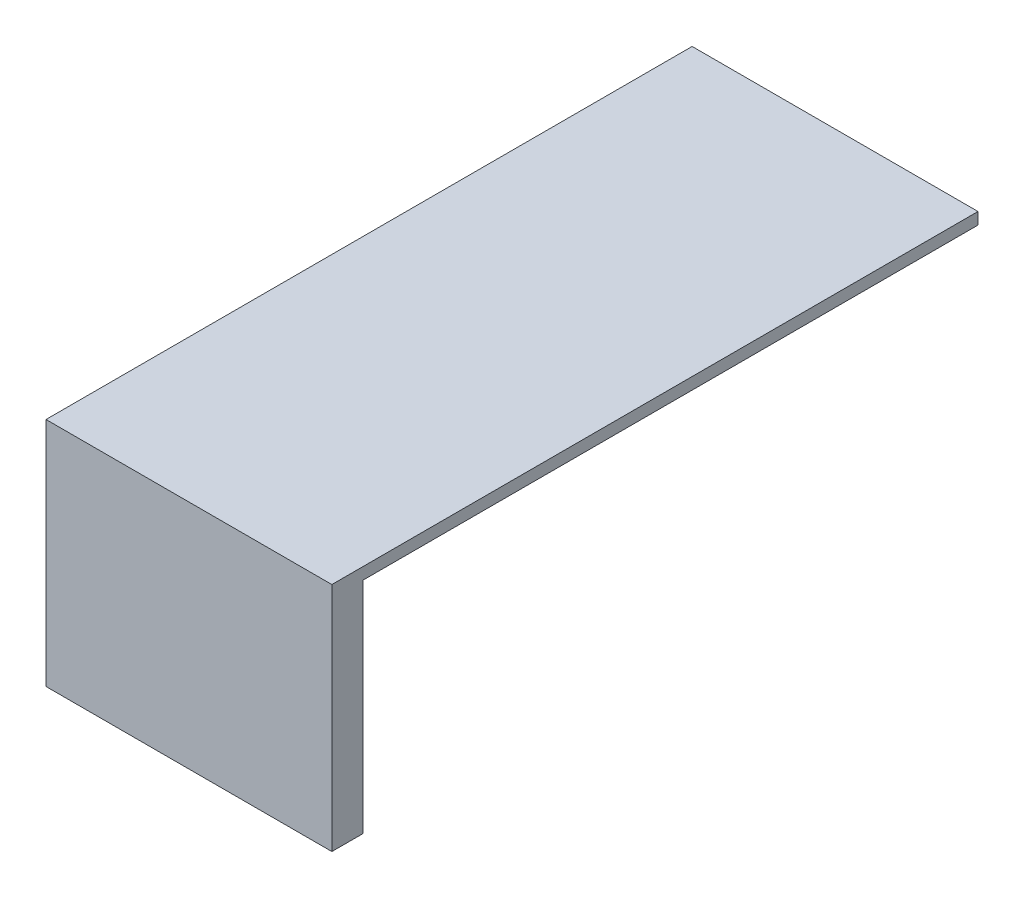
ISO-10303-21;
HEADER;
FILE_DESCRIPTION(('STEP AP214'),'2;1');
FILE_NAME('part.step','',(''),(''),'','','');
FILE_SCHEMA(('AUTOMOTIVE_DESIGN { 1 0 10303 214 1 1 1 1 }'));
ENDSEC;
DATA;
#1=APPLICATION_CONTEXT('core data for automotive mechanical design processes');
#2=APPLICATION_PROTOCOL_DEFINITION('international standard','automotive_design',2000,#1);
#3=PRODUCT_CONTEXT('',#1,'mechanical');
#4=PRODUCT('Part','Part','',(#3));
#5=PRODUCT_RELATED_PRODUCT_CATEGORY('part','',(#4));
#6=PRODUCT_DEFINITION_FORMATION('','',#4);
#7=PRODUCT_DEFINITION_CONTEXT('part definition',#1,'design');
#8=PRODUCT_DEFINITION('design','',#6,#7);
#9=PRODUCT_DEFINITION_SHAPE('','',#8);
#10=(LENGTH_UNIT() NAMED_UNIT(*) SI_UNIT(.MILLI.,.METRE.));
#11=(NAMED_UNIT(*) PLANE_ANGLE_UNIT() SI_UNIT($,.RADIAN.));
#12=(NAMED_UNIT(*) SI_UNIT($,.STERADIAN.) SOLID_ANGLE_UNIT());
#13=UNCERTAINTY_MEASURE_WITH_UNIT(LENGTH_MEASURE(1.E-05),#10,'distance_accuracy_value','');
#14=(GEOMETRIC_REPRESENTATION_CONTEXT(3) GLOBAL_UNCERTAINTY_ASSIGNED_CONTEXT((#13)) GLOBAL_UNIT_ASSIGNED_CONTEXT((#10,
#11,#12)) REPRESENTATION_CONTEXT('',''));
#15=CARTESIAN_POINT('',(0.,0.,0.));
#16=DIRECTION('',(0.,0.,1.));
#17=DIRECTION('',(1.,0.,0.));
#18=AXIS2_PLACEMENT_3D('',#15,#16,#17);
#19=CARTESIAN_POINT('',(0.,0.,0.));
#20=DIRECTION('',(0.,-1.,0.));
#21=DIRECTION('',(0.,0.,-1.));
#22=AXIS2_PLACEMENT_3D('',#19,#20,#21);
#23=PLANE('',#22);
#24=DIRECTION('',(0.,0.,-1.));
#25=VECTOR('',#24,1.);
#26=CARTESIAN_POINT('',(-38.6584539886258,0.,0.));
#27=LINE('',#26,#25);
#28=CARTESIAN_POINT('',(-38.6584539886258,0.,182.141376200391));
#29=VERTEX_POINT('',#28);
#30=CARTESIAN_POINT('',(-38.6584539886258,0.,17.8586237996086));
#31=VERTEX_POINT('',#30);
#32=EDGE_CURVE('E174',#29,#31,#27,.T.);
#33=ORIENTED_EDGE('',*,*,#32,.T.);
#34=DIRECTION('',(-1.,0.,0.));
#35=VECTOR('',#34,1.);
#36=CARTESIAN_POINT('',(0.,0.,17.8586237996086));
#37=LINE('',#36,#35);
#38=CARTESIAN_POINT('',(-111.341546011374,0.,17.8586237996086));
#39=VERTEX_POINT('',#38);
#40=EDGE_CURVE('E146',#31,#39,#37,.T.);
#41=ORIENTED_EDGE('',*,*,#40,.T.);
#42=DIRECTION('',(0.,0.,-1.));
#43=VECTOR('',#42,1.);
#44=CARTESIAN_POINT('',(-111.341546011374,0.,182.141376200391));
#45=LINE('',#44,#43);
#46=CARTESIAN_POINT('',(-111.341546011374,0.,182.141376200391));
#47=VERTEX_POINT('',#46);
#48=EDGE_CURVE('E119',#47,#39,#45,.T.);
#49=ORIENTED_EDGE('',*,*,#48,.F.);
#50=DIRECTION('',(-1.,0.,0.));
#51=VECTOR('',#50,1.);
#52=CARTESIAN_POINT('',(-111.341546011374,0.,182.141376200391));
#53=LINE('',#52,#51);
#54=EDGE_CURVE('E133',#29,#47,#53,.T.);
#55=ORIENTED_EDGE('',*,*,#54,.F.);
#56=EDGE_LOOP('',(#33,#41,#49,#55));
#57=FACE_BOUND('',#56,.T.);
#58=ADVANCED_FACE('F39',(#57),#23,.F.);
#59=CARTESIAN_POINT('',(0.,-58.8,0.));
#60=DIRECTION('',(0.,-1.,0.));
#61=DIRECTION('',(0.,0.,-1.));
#62=AXIS2_PLACEMENT_3D('',#59,#60,#61);
#63=PLANE('',#62);
#64=DIRECTION('',(-1.,0.,0.));
#65=VECTOR('',#64,1.);
#66=CARTESIAN_POINT('',(-38.6584539886258,-58.8,17.8586237996086));
#67=LINE('',#66,#65);
#68=CARTESIAN_POINT('',(-103.958701758156,-58.8,17.8586237996086));
#69=VERTEX_POINT('',#68);
#70=CARTESIAN_POINT('',(-111.341546011374,-58.8,17.8586237996086));
#71=VERTEX_POINT('',#70);
#72=EDGE_CURVE('E99',#69,#71,#67,.T.);
#73=ORIENTED_EDGE('',*,*,#72,.F.);
#74=DIRECTION('',(0.,0.,-1.));
#75=VECTOR('',#74,1.);
#76=CARTESIAN_POINT('',(-103.958701758156,-58.8,174.272148859892));
#77=LINE('',#76,#75);
#78=CARTESIAN_POINT('',(-103.958701758156,-58.8,174.272148859892));
#79=VERTEX_POINT('',#78);
#80=EDGE_CURVE('E161',#79,#69,#77,.T.);
#81=ORIENTED_EDGE('',*,*,#80,.F.);
#82=DIRECTION('',(-1.,0.,0.));
#83=VECTOR('',#82,1.);
#84=CARTESIAN_POINT('',(-103.958701758156,-58.8,174.272148859892));
#85=LINE('',#84,#83);
#86=CARTESIAN_POINT('',(-38.6584539886258,-58.8,174.272148859892));
#87=VERTEX_POINT('',#86);
#88=EDGE_CURVE('E165',#87,#79,#85,.T.);
#89=ORIENTED_EDGE('',*,*,#88,.F.);
#90=DIRECTION('',(0.,0.,-1.));
#91=VECTOR('',#90,1.);
#92=CARTESIAN_POINT('',(-38.6584539886258,-58.8,17.8586237996086));
#93=LINE('',#92,#91);
#94=CARTESIAN_POINT('',(-38.6584539886258,-58.8,182.141376200391));
#95=VERTEX_POINT('',#94);
#96=EDGE_CURVE('E110',#95,#87,#93,.T.);
#97=ORIENTED_EDGE('',*,*,#96,.F.);
#98=DIRECTION('',(-1.,0.,0.));
#99=VECTOR('',#98,1.);
#100=CARTESIAN_POINT('',(-111.341546011374,-58.8,182.141376200391));
#101=LINE('',#100,#99);
#102=CARTESIAN_POINT('',(-111.341546011374,-58.8,182.141376200391));
#103=VERTEX_POINT('',#102);
#104=EDGE_CURVE('E64',#95,#103,#101,.T.);
#105=ORIENTED_EDGE('',*,*,#104,.T.);
#106=DIRECTION('',(0.,0.,-1.));
#107=VECTOR('',#106,1.);
#108=CARTESIAN_POINT('',(-111.341546011374,-58.8,182.141376200391));
#109=LINE('',#108,#107);
#110=EDGE_CURVE('E117',#103,#71,#109,.T.);
#111=ORIENTED_EDGE('',*,*,#110,.T.);
#112=EDGE_LOOP('',(#73,#81,#89,#97,#105,#111));
#113=FACE_BOUND('',#112,.T.);
#114=ADVANCED_FACE('F123',(#113),#63,.T.);
#115=CARTESIAN_POINT('',(-111.341546011374,-58.8,182.141376200391));
#116=DIRECTION('',(1.,0.,0.));
#117=DIRECTION('',(0.,0.,-1.));
#118=AXIS2_PLACEMENT_3D('',#115,#116,#117);
#119=PLANE('',#118);
#120=ORIENTED_EDGE('',*,*,#48,.T.);
#121=DIRECTION('',(0.,-1.,0.));
#122=VECTOR('',#121,1.);
#123=CARTESIAN_POINT('',(-111.341546011374,441.2,17.8586237996086));
#124=LINE('',#123,#122);
#125=EDGE_CURVE('E103',#39,#71,#124,.T.);
#126=ORIENTED_EDGE('',*,*,#125,.T.);
#127=ORIENTED_EDGE('',*,*,#110,.F.);
#128=DIRECTION('',(0.,1.,0.));
#129=VECTOR('',#128,1.);
#130=CARTESIAN_POINT('',(-111.341546011374,-58.8,182.141376200391));
#131=LINE('',#130,#129);
#132=EDGE_CURVE('E125',#103,#47,#131,.T.);
#133=ORIENTED_EDGE('',*,*,#132,.T.);
#134=EDGE_LOOP('',(#120,#126,#127,#133));
#135=FACE_BOUND('',#134,.T.);
#136=ADVANCED_FACE('F115',(#135),#119,.F.);
#137=CARTESIAN_POINT('',(-111.341546011374,-58.8,182.141376200391));
#138=DIRECTION('',(0.,0.,-1.));
#139=DIRECTION('',(-1.,0.,0.));
#140=AXIS2_PLACEMENT_3D('',#137,#138,#139);
#141=PLANE('',#140);
#142=ORIENTED_EDGE('',*,*,#104,.F.);
#143=DIRECTION('',(0.,-1.,0.));
#144=VECTOR('',#143,1.);
#145=CARTESIAN_POINT('',(-38.6584539886258,441.2,182.141376200391));
#146=LINE('',#145,#144);
#147=EDGE_CURVE('E121',#29,#95,#146,.T.);
#148=ORIENTED_EDGE('',*,*,#147,.F.);
#149=ORIENTED_EDGE('',*,*,#54,.T.);
#150=ORIENTED_EDGE('',*,*,#132,.F.);
#151=EDGE_LOOP('',(#142,#148,#149,#150));
#152=FACE_BOUND('',#151,.T.);
#153=ADVANCED_FACE('F41',(#152),#141,.F.);
#154=CARTESIAN_POINT('',(-103.958701758156,-3.,174.272148859892));
#155=DIRECTION('',(-1.,0.,0.));
#156=DIRECTION('',(0.,0.,1.));
#157=AXIS2_PLACEMENT_3D('',#154,#155,#156);
#158=PLANE('',#157);
#159=ORIENTED_EDGE('',*,*,#80,.T.);
#160=DIRECTION('',(0.,1.,0.));
#161=VECTOR('',#160,1.);
#162=CARTESIAN_POINT('',(-103.958701758156,-3.,17.8586237996086));
#163=LINE('',#162,#161);
#164=CARTESIAN_POINT('',(-103.958701758156,-3.,17.8586237996086));
#165=VERTEX_POINT('',#164);
#166=EDGE_CURVE('E106',#69,#165,#163,.T.);
#167=ORIENTED_EDGE('',*,*,#166,.T.);
#168=DIRECTION('',(0.,0.,-1.));
#169=VECTOR('',#168,1.);
#170=CARTESIAN_POINT('',(-103.958701758156,-3.,174.272148859892));
#171=LINE('',#170,#169);
#172=CARTESIAN_POINT('',(-103.958701758156,-3.,174.272148859892));
#173=VERTEX_POINT('',#172);
#174=EDGE_CURVE('E152',#173,#165,#171,.T.);
#175=ORIENTED_EDGE('',*,*,#174,.F.);
#176=DIRECTION('',(0.,-1.,0.));
#177=VECTOR('',#176,1.);
#178=CARTESIAN_POINT('',(-103.958701758156,-3.,174.272148859892));
#179=LINE('',#178,#177);
#180=EDGE_CURVE('E136',#173,#79,#179,.T.);
#181=ORIENTED_EDGE('',*,*,#180,.T.);
#182=EDGE_LOOP('',(#159,#167,#175,#181));
#183=FACE_BOUND('',#182,.T.);
#184=ADVANCED_FACE('F169',(#183),#158,.F.);
#185=CARTESIAN_POINT('',(-103.958701758156,-3.,174.272148859892));
#186=DIRECTION('',(0.,0.,1.));
#187=DIRECTION('',(1.,0.,0.));
#188=AXIS2_PLACEMENT_3D('',#185,#186,#187);
#189=PLANE('',#188);
#190=DIRECTION('',(-1.,0.,0.));
#191=VECTOR('',#190,1.);
#192=CARTESIAN_POINT('',(-103.958701758156,-3.,174.272148859892));
#193=LINE('',#192,#191);
#194=CARTESIAN_POINT('',(-38.6584539886258,-3.,174.272148859892));
#195=VERTEX_POINT('',#194);
#196=EDGE_CURVE('E153',#195,#173,#193,.T.);
#197=ORIENTED_EDGE('',*,*,#196,.F.);
#198=DIRECTION('',(0.,-1.,0.));
#199=VECTOR('',#198,1.);
#200=CARTESIAN_POINT('',(-38.6584539886258,-3.,174.272148859892));
#201=LINE('',#200,#199);
#202=EDGE_CURVE('E55',#195,#87,#201,.T.);
#203=ORIENTED_EDGE('',*,*,#202,.T.);
#204=ORIENTED_EDGE('',*,*,#88,.T.);
#205=ORIENTED_EDGE('',*,*,#180,.F.);
#206=EDGE_LOOP('',(#197,#203,#204,#205));
#207=FACE_BOUND('',#206,.T.);
#208=ADVANCED_FACE('F172',(#207),#189,.F.);
#209=CARTESIAN_POINT('',(0.,-3.,0.));
#210=DIRECTION('',(0.,-1.,0.));
#211=DIRECTION('',(0.,0.,-1.));
#212=AXIS2_PLACEMENT_3D('',#209,#210,#211);
#213=PLANE('',#212);
#214=DIRECTION('',(-1.,0.,0.));
#215=VECTOR('',#214,1.);
#216=CARTESIAN_POINT('',(0.,-3.,17.8586237996086));
#217=LINE('',#216,#215);
#218=CARTESIAN_POINT('',(-38.6584539886258,-3.,17.8586237996086));
#219=VERTEX_POINT('',#218);
#220=EDGE_CURVE('E11',#219,#165,#217,.T.);
#221=ORIENTED_EDGE('',*,*,#220,.F.);
#222=DIRECTION('',(0.,0.,-1.));
#223=VECTOR('',#222,1.);
#224=CARTESIAN_POINT('',(-38.6584539886258,-3.,0.));
#225=LINE('',#224,#223);
#226=EDGE_CURVE('E48',#195,#219,#225,.T.);
#227=ORIENTED_EDGE('',*,*,#226,.F.);
#228=ORIENTED_EDGE('',*,*,#196,.T.);
#229=ORIENTED_EDGE('',*,*,#174,.T.);
#230=EDGE_LOOP('',(#221,#227,#228,#229));
#231=FACE_BOUND('',#230,.T.);
#232=ADVANCED_FACE('F150',(#231),#213,.T.);
#233=CARTESIAN_POINT('',(-38.6584539886258,441.2,17.8586237996086));
#234=DIRECTION('',(0.,0.,1.));
#235=DIRECTION('',(1.,0.,0.));
#236=AXIS2_PLACEMENT_3D('',#233,#234,#235);
#237=PLANE('',#236);
#238=DIRECTION('',(0.,-1.,0.));
#239=VECTOR('',#238,1.);
#240=CARTESIAN_POINT('',(-38.6584539886258,441.2,17.8586237996086));
#241=LINE('',#240,#239);
#242=EDGE_CURVE('E141',#31,#219,#241,.T.);
#243=ORIENTED_EDGE('',*,*,#242,.T.);
#244=ORIENTED_EDGE('',*,*,#220,.T.);
#245=ORIENTED_EDGE('',*,*,#166,.F.);
#246=ORIENTED_EDGE('',*,*,#72,.T.);
#247=ORIENTED_EDGE('',*,*,#125,.F.);
#248=ORIENTED_EDGE('',*,*,#40,.F.);
#249=EDGE_LOOP('',(#243,#244,#245,#246,#247,#248));
#250=FACE_BOUND('',#249,.T.);
#251=ADVANCED_FACE('F102',(#250),#237,.F.);
#252=CARTESIAN_POINT('',(-38.6584539886258,441.2,17.8586237996086));
#253=DIRECTION('',(-1.,0.,0.));
#254=DIRECTION('',(0.,0.,1.));
#255=AXIS2_PLACEMENT_3D('',#252,#253,#254);
#256=PLANE('',#255);
#257=ORIENTED_EDGE('',*,*,#147,.T.);
#258=ORIENTED_EDGE('',*,*,#96,.T.);
#259=ORIENTED_EDGE('',*,*,#202,.F.);
#260=ORIENTED_EDGE('',*,*,#226,.T.);
#261=ORIENTED_EDGE('',*,*,#242,.F.);
#262=ORIENTED_EDGE('',*,*,#32,.F.);
#263=EDGE_LOOP('',(#257,#258,#259,#260,#261,#262));
#264=FACE_BOUND('',#263,.T.);
#265=ADVANCED_FACE('F140',(#264),#256,.F.);
#266=CLOSED_SHELL('',(#58,#114,#136,#153,#184,#208,#232,#251,#265));
#267=MANIFOLD_SOLID_BREP('B2',#266);
#268=ADVANCED_BREP_SHAPE_REPRESENTATION('',(#18,#267),#14);
#269=SHAPE_DEFINITION_REPRESENTATION(#9,#268);
ENDSEC;
END-ISO-10303-21;
